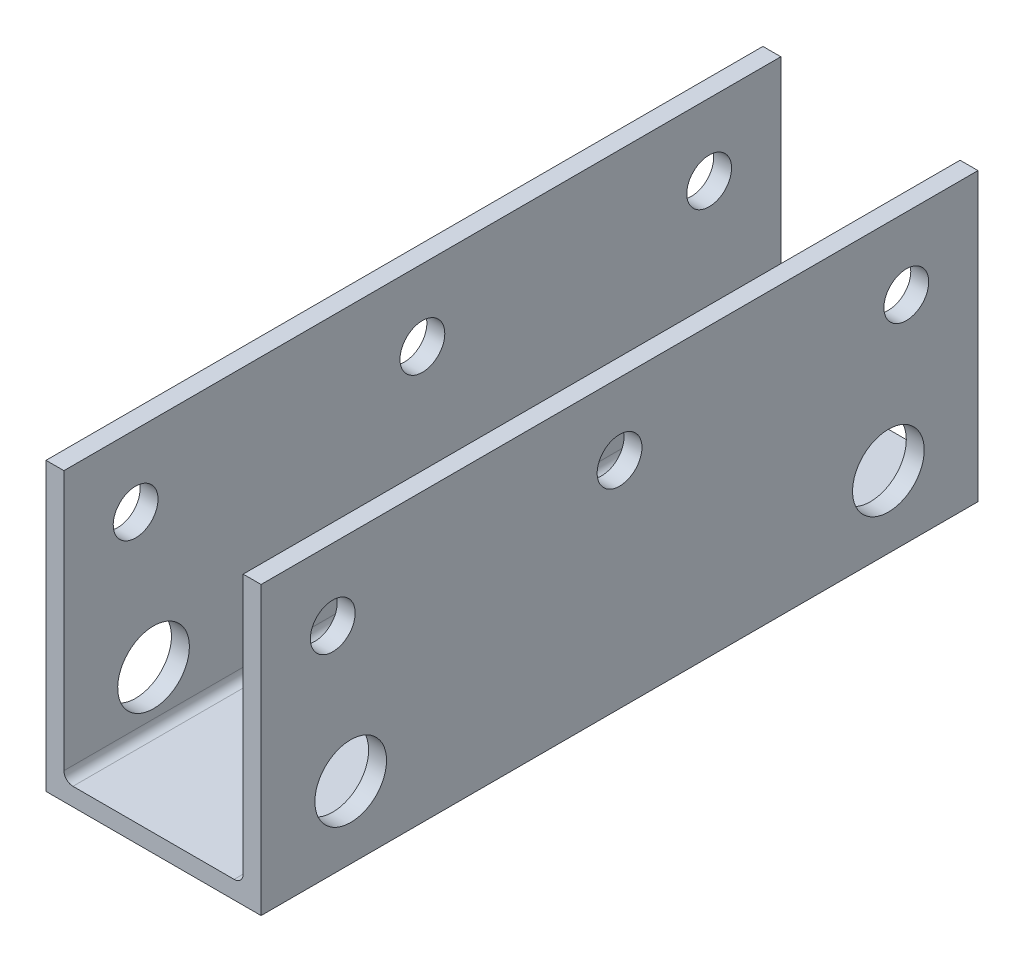
ISO-10303-21;
HEADER;
FILE_DESCRIPTION(('STEP AP214'),'2;1');
FILE_NAME('part.step','',(''),(''),'','','');
FILE_SCHEMA(('AUTOMOTIVE_DESIGN { 1 0 10303 214 1 1 1 1 }'));
ENDSEC;
DATA;
#1=APPLICATION_CONTEXT('core data for automotive mechanical design processes');
#2=APPLICATION_PROTOCOL_DEFINITION('international standard','automotive_design',2000,#1);
#3=PRODUCT_CONTEXT('',#1,'mechanical');
#4=PRODUCT('Part','Part','',(#3));
#5=PRODUCT_RELATED_PRODUCT_CATEGORY('part','',(#4));
#6=PRODUCT_DEFINITION_FORMATION('','',#4);
#7=PRODUCT_DEFINITION_CONTEXT('part definition',#1,'design');
#8=PRODUCT_DEFINITION('design','',#6,#7);
#9=PRODUCT_DEFINITION_SHAPE('','',#8);
#10=(LENGTH_UNIT() NAMED_UNIT(*) SI_UNIT(.MILLI.,.METRE.));
#11=(NAMED_UNIT(*) PLANE_ANGLE_UNIT() SI_UNIT($,.RADIAN.));
#12=(NAMED_UNIT(*) SI_UNIT($,.STERADIAN.) SOLID_ANGLE_UNIT());
#13=UNCERTAINTY_MEASURE_WITH_UNIT(LENGTH_MEASURE(1.E-05),#10,'distance_accuracy_value','');
#14=(GEOMETRIC_REPRESENTATION_CONTEXT(3) GLOBAL_UNCERTAINTY_ASSIGNED_CONTEXT((#13)) GLOBAL_UNIT_ASSIGNED_CONTEXT((#10,
#11,#12)) REPRESENTATION_CONTEXT('',''));
#15=CARTESIAN_POINT('',(0.,0.,0.));
#16=DIRECTION('',(0.,0.,1.));
#17=DIRECTION('',(1.,0.,0.));
#18=AXIS2_PLACEMENT_3D('',#15,#16,#17);
#19=CARTESIAN_POINT('',(0.,0.,127.));
#20=DIRECTION('',(1.,0.,0.));
#21=DIRECTION('',(0.,0.,-1.));
#22=AXIS2_PLACEMENT_3D('',#19,#20,#21);
#23=PLANE('',#22);
#24=CARTESIAN_POINT('',(0.,38.1,12.7));
#25=DIRECTION('',(1.,0.,0.));
#26=DIRECTION('',(0.,0.,-1.));
#27=AXIS2_PLACEMENT_3D('',#24,#25,#26);
#28=CIRCLE('',#27,3.96875);
#29=CARTESIAN_POINT('',(0.,38.1,8.73125));
#30=VERTEX_POINT('',#29);
#31=EDGE_CURVE('E265',#30,#30,#28,.T.);
#32=ORIENTED_EDGE('',*,*,#31,.T.);
#33=EDGE_LOOP('',(#32));
#34=FACE_BOUND('',#33,.T.);
#35=CARTESIAN_POINT('',(0.,38.1,63.5));
#36=DIRECTION('',(1.,0.,0.));
#37=DIRECTION('',(0.,0.,-1.));
#38=AXIS2_PLACEMENT_3D('',#35,#36,#37);
#39=CIRCLE('',#38,3.96875000000001);
#40=CARTESIAN_POINT('',(0.,38.1,59.53125));
#41=VERTEX_POINT('',#40);
#42=EDGE_CURVE('E182',#41,#41,#39,.T.);
#43=ORIENTED_EDGE('',*,*,#42,.T.);
#44=EDGE_LOOP('',(#43));
#45=FACE_BOUND('',#44,.T.);
#46=CARTESIAN_POINT('',(0.,38.1,114.3));
#47=DIRECTION('',(1.,0.,0.));
#48=DIRECTION('',(0.,0.,-1.));
#49=AXIS2_PLACEMENT_3D('',#46,#47,#48);
#50=CIRCLE('',#49,3.96874999999999);
#51=CARTESIAN_POINT('',(0.,38.1,110.33125));
#52=VERTEX_POINT('',#51);
#53=EDGE_CURVE('E177',#52,#52,#50,.T.);
#54=ORIENTED_EDGE('',*,*,#53,.T.);
#55=EDGE_LOOP('',(#54));
#56=FACE_BOUND('',#55,.T.);
#57=CARTESIAN_POINT('',(0.,12.7,111.125));
#58=DIRECTION('',(1.,0.,0.));
#59=DIRECTION('',(0.,0.,-1.));
#60=AXIS2_PLACEMENT_3D('',#57,#58,#59);
#61=CIRCLE('',#60,6.35);
#62=CARTESIAN_POINT('',(0.,12.7,104.775));
#63=VERTEX_POINT('',#62);
#64=EDGE_CURVE('E171',#63,#63,#61,.T.);
#65=ORIENTED_EDGE('',*,*,#64,.T.);
#66=EDGE_LOOP('',(#65));
#67=FACE_BOUND('',#66,.T.);
#68=CARTESIAN_POINT('',(0.,12.7,15.875));
#69=DIRECTION('',(1.,0.,0.));
#70=DIRECTION('',(0.,0.,-1.));
#71=AXIS2_PLACEMENT_3D('',#68,#69,#70);
#72=CIRCLE('',#71,6.35);
#73=CARTESIAN_POINT('',(0.,12.7,9.525));
#74=VERTEX_POINT('',#73);
#75=EDGE_CURVE('E165',#74,#74,#72,.T.);
#76=ORIENTED_EDGE('',*,*,#75,.T.);
#77=EDGE_LOOP('',(#76));
#78=FACE_BOUND('',#77,.T.);
#79=DIRECTION('',(0.,-1.,0.));
#80=VECTOR('',#79,1.);
#81=CARTESIAN_POINT('',(0.,0.,0.));
#82=LINE('',#81,#80);
#83=CARTESIAN_POINT('',(0.,50.8,0.));
#84=VERTEX_POINT('',#83);
#85=CARTESIAN_POINT('',(0.,0.,0.));
#86=VERTEX_POINT('',#85);
#87=EDGE_CURVE('E141',#84,#86,#82,.T.);
#88=ORIENTED_EDGE('',*,*,#87,.T.);
#89=DIRECTION('',(0.,0.,-1.));
#90=VECTOR('',#89,1.);
#91=CARTESIAN_POINT('',(0.,0.,127.));
#92=LINE('',#91,#90);
#93=CARTESIAN_POINT('',(0.,0.,127.));
#94=VERTEX_POINT('',#93);
#95=EDGE_CURVE('E120',#94,#86,#92,.T.);
#96=ORIENTED_EDGE('',*,*,#95,.F.);
#97=DIRECTION('',(0.,-1.,0.));
#98=VECTOR('',#97,1.);
#99=CARTESIAN_POINT('',(0.,0.,127.));
#100=LINE('',#99,#98);
#101=CARTESIAN_POINT('',(0.,50.8,127.));
#102=VERTEX_POINT('',#101);
#103=EDGE_CURVE('E128',#102,#94,#100,.T.);
#104=ORIENTED_EDGE('',*,*,#103,.F.);
#105=DIRECTION('',(0.,0.,-1.));
#106=VECTOR('',#105,1.);
#107=CARTESIAN_POINT('',(0.,50.8,127.));
#108=LINE('',#107,#106);
#109=EDGE_CURVE('E236',#102,#84,#108,.T.);
#110=ORIENTED_EDGE('',*,*,#109,.T.);
#111=EDGE_LOOP('',(#88,#96,#104,#110));
#112=FACE_BOUND('',#111,.T.);
#113=ADVANCED_FACE('F38',(#34,#45,#56,#67,#78,#112),#23,.F.);
#114=CARTESIAN_POINT('',(0.,0.,127.));
#115=DIRECTION('',(0.,1.,0.));
#116=DIRECTION('',(0.,0.,1.));
#117=AXIS2_PLACEMENT_3D('',#114,#115,#116);
#118=PLANE('',#117);
#119=DIRECTION('',(1.,0.,0.));
#120=VECTOR('',#119,1.);
#121=CARTESIAN_POINT('',(0.,0.,0.));
#122=LINE('',#121,#120);
#123=CARTESIAN_POINT('',(38.1,0.,0.));
#124=VERTEX_POINT('',#123);
#125=EDGE_CURVE('E258',#86,#124,#122,.T.);
#126=ORIENTED_EDGE('',*,*,#125,.T.);
#127=DIRECTION('',(0.,0.,-1.));
#128=VECTOR('',#127,1.);
#129=CARTESIAN_POINT('',(38.1,0.,127.));
#130=LINE('',#129,#128);
#131=CARTESIAN_POINT('',(38.1,0.,127.));
#132=VERTEX_POINT('',#131);
#133=EDGE_CURVE('E123',#132,#124,#130,.T.);
#134=ORIENTED_EDGE('',*,*,#133,.F.);
#135=DIRECTION('',(1.,0.,0.));
#136=VECTOR('',#135,1.);
#137=CARTESIAN_POINT('',(0.,0.,127.));
#138=LINE('',#137,#136);
#139=EDGE_CURVE('E116',#94,#132,#138,.T.);
#140=ORIENTED_EDGE('',*,*,#139,.F.);
#141=ORIENTED_EDGE('',*,*,#95,.T.);
#142=EDGE_LOOP('',(#126,#134,#140,#141));
#143=FACE_BOUND('',#142,.T.);
#144=ADVANCED_FACE('F118',(#143),#118,.F.);
#145=CARTESIAN_POINT('',(38.1,0.,127.));
#146=DIRECTION('',(-1.,0.,0.));
#147=DIRECTION('',(0.,0.,1.));
#148=AXIS2_PLACEMENT_3D('',#145,#146,#147);
#149=PLANE('',#148);
#150=CARTESIAN_POINT('',(38.1,38.1,12.7));
#151=DIRECTION('',(1.,0.,0.));
#152=DIRECTION('',(0.,0.,-1.));
#153=AXIS2_PLACEMENT_3D('',#150,#151,#152);
#154=CIRCLE('',#153,3.96875);
#155=CARTESIAN_POINT('',(38.1,38.1,8.73125));
#156=VERTEX_POINT('',#155);
#157=EDGE_CURVE('E311',#156,#156,#154,.T.);
#158=ORIENTED_EDGE('',*,*,#157,.F.);
#159=EDGE_LOOP('',(#158));
#160=FACE_BOUND('',#159,.T.);
#161=CARTESIAN_POINT('',(38.1,38.1,63.5));
#162=DIRECTION('',(1.,0.,0.));
#163=DIRECTION('',(0.,0.,-1.));
#164=AXIS2_PLACEMENT_3D('',#161,#162,#163);
#165=CIRCLE('',#164,3.96875000000001);
#166=CARTESIAN_POINT('',(38.1,38.1,59.53125));
#167=VERTEX_POINT('',#166);
#168=EDGE_CURVE('E315',#167,#167,#165,.T.);
#169=ORIENTED_EDGE('',*,*,#168,.F.);
#170=EDGE_LOOP('',(#169));
#171=FACE_BOUND('',#170,.T.);
#172=CARTESIAN_POINT('',(38.1,38.1,114.3));
#173=DIRECTION('',(1.,0.,0.));
#174=DIRECTION('',(0.,0.,-1.));
#175=AXIS2_PLACEMENT_3D('',#172,#173,#174);
#176=CIRCLE('',#175,3.96874999999999);
#177=CARTESIAN_POINT('',(38.1,38.1,110.33125));
#178=VERTEX_POINT('',#177);
#179=EDGE_CURVE('E319',#178,#178,#176,.T.);
#180=ORIENTED_EDGE('',*,*,#179,.F.);
#181=EDGE_LOOP('',(#180));
#182=FACE_BOUND('',#181,.T.);
#183=CARTESIAN_POINT('',(38.1,12.7,111.125));
#184=DIRECTION('',(1.,0.,0.));
#185=DIRECTION('',(0.,0.,-1.));
#186=AXIS2_PLACEMENT_3D('',#183,#184,#185);
#187=CIRCLE('',#186,6.35);
#188=CARTESIAN_POINT('',(38.1,12.7,104.775));
#189=VERTEX_POINT('',#188);
#190=EDGE_CURVE('E310',#189,#189,#187,.T.);
#191=ORIENTED_EDGE('',*,*,#190,.F.);
#192=EDGE_LOOP('',(#191));
#193=FACE_BOUND('',#192,.T.);
#194=CARTESIAN_POINT('',(38.1,12.7,15.875));
#195=DIRECTION('',(1.,0.,0.));
#196=DIRECTION('',(0.,0.,-1.));
#197=AXIS2_PLACEMENT_3D('',#194,#195,#196);
#198=CIRCLE('',#197,6.35);
#199=CARTESIAN_POINT('',(38.1,12.7,9.525));
#200=VERTEX_POINT('',#199);
#201=EDGE_CURVE('E159',#200,#200,#198,.T.);
#202=ORIENTED_EDGE('',*,*,#201,.F.);
#203=EDGE_LOOP('',(#202));
#204=FACE_BOUND('',#203,.T.);
#205=DIRECTION('',(0.,1.,0.));
#206=VECTOR('',#205,1.);
#207=CARTESIAN_POINT('',(38.1,0.,0.));
#208=LINE('',#207,#206);
#209=CARTESIAN_POINT('',(38.1,50.8,0.));
#210=VERTEX_POINT('',#209);
#211=EDGE_CURVE('E255',#124,#210,#208,.T.);
#212=ORIENTED_EDGE('',*,*,#211,.T.);
#213=DIRECTION('',(0.,0.,-1.));
#214=VECTOR('',#213,1.);
#215=CARTESIAN_POINT('',(38.1,50.8,127.));
#216=LINE('',#215,#214);
#217=CARTESIAN_POINT('',(38.1,50.8,127.));
#218=VERTEX_POINT('',#217);
#219=EDGE_CURVE('E150',#218,#210,#216,.T.);
#220=ORIENTED_EDGE('',*,*,#219,.F.);
#221=DIRECTION('',(0.,1.,0.));
#222=VECTOR('',#221,1.);
#223=CARTESIAN_POINT('',(38.1,0.,127.));
#224=LINE('',#223,#222);
#225=EDGE_CURVE('E127',#132,#218,#224,.T.);
#226=ORIENTED_EDGE('',*,*,#225,.F.);
#227=ORIENTED_EDGE('',*,*,#133,.T.);
#228=EDGE_LOOP('',(#212,#220,#226,#227));
#229=FACE_BOUND('',#228,.T.);
#230=ADVANCED_FACE('F330',(#160,#171,#182,#193,#204,#229),#149,.F.);
#231=CARTESIAN_POINT('',(34.925,50.8,127.));
#232=DIRECTION('',(0.,-1.,0.));
#233=DIRECTION('',(0.,0.,-1.));
#234=AXIS2_PLACEMENT_3D('',#231,#232,#233);
#235=PLANE('',#234);
#236=DIRECTION('',(-1.,0.,0.));
#237=VECTOR('',#236,1.);
#238=CARTESIAN_POINT('',(34.925,50.8,0.));
#239=LINE('',#238,#237);
#240=CARTESIAN_POINT('',(34.925,50.8,0.));
#241=VERTEX_POINT('',#240);
#242=EDGE_CURVE('E230',#210,#241,#239,.T.);
#243=ORIENTED_EDGE('',*,*,#242,.T.);
#244=DIRECTION('',(0.,0.,-1.));
#245=VECTOR('',#244,1.);
#246=CARTESIAN_POINT('',(34.925,50.8,127.));
#247=LINE('',#246,#245);
#248=CARTESIAN_POINT('',(34.925,50.8,127.));
#249=VERTEX_POINT('',#248);
#250=EDGE_CURVE('E241',#249,#241,#247,.T.);
#251=ORIENTED_EDGE('',*,*,#250,.F.);
#252=DIRECTION('',(-1.,0.,0.));
#253=VECTOR('',#252,1.);
#254=CARTESIAN_POINT('',(34.925,50.8,127.));
#255=LINE('',#254,#253);
#256=EDGE_CURVE('E252',#218,#249,#255,.T.);
#257=ORIENTED_EDGE('',*,*,#256,.F.);
#258=ORIENTED_EDGE('',*,*,#219,.T.);
#259=EDGE_LOOP('',(#243,#251,#257,#258));
#260=FACE_BOUND('',#259,.T.);
#261=ADVANCED_FACE('F250',(#260),#235,.F.);
#262=CARTESIAN_POINT('',(34.925,3.175,127.));
#263=DIRECTION('',(1.,0.,0.));
#264=DIRECTION('',(0.,0.,-1.));
#265=AXIS2_PLACEMENT_3D('',#262,#263,#264);
#266=PLANE('',#265);
#267=CARTESIAN_POINT('',(34.925,38.1,12.7));
#268=DIRECTION('',(1.,0.,0.));
#269=DIRECTION('',(0.,0.,-1.));
#270=AXIS2_PLACEMENT_3D('',#267,#268,#269);
#271=CIRCLE('',#270,3.96875);
#272=CARTESIAN_POINT('',(34.925,38.1,8.73125));
#273=VERTEX_POINT('',#272);
#274=EDGE_CURVE('E181',#273,#273,#271,.T.);
#275=ORIENTED_EDGE('',*,*,#274,.T.);
#276=EDGE_LOOP('',(#275));
#277=FACE_BOUND('',#276,.T.);
#278=CARTESIAN_POINT('',(34.925,38.1,63.5));
#279=DIRECTION('',(1.,0.,0.));
#280=DIRECTION('',(0.,0.,-1.));
#281=AXIS2_PLACEMENT_3D('',#278,#279,#280);
#282=CIRCLE('',#281,3.96875000000001);
#283=CARTESIAN_POINT('',(34.925,38.1,59.53125));
#284=VERTEX_POINT('',#283);
#285=EDGE_CURVE('E176',#284,#284,#282,.T.);
#286=ORIENTED_EDGE('',*,*,#285,.T.);
#287=EDGE_LOOP('',(#286));
#288=FACE_BOUND('',#287,.T.);
#289=CARTESIAN_POINT('',(34.925,38.1,114.3));
#290=DIRECTION('',(1.,0.,0.));
#291=DIRECTION('',(0.,0.,-1.));
#292=AXIS2_PLACEMENT_3D('',#289,#290,#291);
#293=CIRCLE('',#292,3.96874999999999);
#294=CARTESIAN_POINT('',(34.925,38.1,110.33125));
#295=VERTEX_POINT('',#294);
#296=EDGE_CURVE('E170',#295,#295,#293,.T.);
#297=ORIENTED_EDGE('',*,*,#296,.T.);
#298=EDGE_LOOP('',(#297));
#299=FACE_BOUND('',#298,.T.);
#300=CARTESIAN_POINT('',(34.925,12.7,111.125));
#301=DIRECTION('',(1.,0.,0.));
#302=DIRECTION('',(0.,0.,-1.));
#303=AXIS2_PLACEMENT_3D('',#300,#301,#302);
#304=CIRCLE('',#303,6.35);
#305=CARTESIAN_POINT('',(34.925,12.7,104.775));
#306=VERTEX_POINT('',#305);
#307=EDGE_CURVE('E164',#306,#306,#304,.T.);
#308=ORIENTED_EDGE('',*,*,#307,.T.);
#309=EDGE_LOOP('',(#308));
#310=FACE_BOUND('',#309,.T.);
#311=CARTESIAN_POINT('',(34.925,12.7,15.875));
#312=DIRECTION('',(1.,0.,0.));
#313=DIRECTION('',(0.,0.,-1.));
#314=AXIS2_PLACEMENT_3D('',#311,#312,#313);
#315=CIRCLE('',#314,6.35);
#316=CARTESIAN_POINT('',(34.925,12.7,9.525));
#317=VERTEX_POINT('',#316);
#318=EDGE_CURVE('E158',#317,#317,#315,.T.);
#319=ORIENTED_EDGE('',*,*,#318,.T.);
#320=EDGE_LOOP('',(#319));
#321=FACE_BOUND('',#320,.T.);
#322=DIRECTION('',(0.,-1.,0.));
#323=VECTOR('',#322,1.);
#324=CARTESIAN_POINT('',(34.925,3.175,0.));
#325=LINE('',#324,#323);
#326=CARTESIAN_POINT('',(34.925,4.7752,0.));
#327=VERTEX_POINT('',#326);
#328=EDGE_CURVE('E225',#241,#327,#325,.T.);
#329=ORIENTED_EDGE('',*,*,#328,.T.);
#330=DIRECTION('',(0.,0.,-1.));
#331=VECTOR('',#330,1.);
#332=CARTESIAN_POINT('',(34.925,4.7752,127.));
#333=LINE('',#332,#331);
#334=CARTESIAN_POINT('',(34.925,4.7752,127.));
#335=VERTEX_POINT('',#334);
#336=EDGE_CURVE('E54',#327,#335,#333,.F.);
#337=ORIENTED_EDGE('',*,*,#336,.T.);
#338=DIRECTION('',(0.,-1.,0.));
#339=VECTOR('',#338,1.);
#340=CARTESIAN_POINT('',(34.925,3.175,127.));
#341=LINE('',#340,#339);
#342=EDGE_CURVE('E270',#249,#335,#341,.T.);
#343=ORIENTED_EDGE('',*,*,#342,.F.);
#344=ORIENTED_EDGE('',*,*,#250,.T.);
#345=EDGE_LOOP('',(#329,#337,#343,#344));
#346=FACE_BOUND('',#345,.T.);
#347=ADVANCED_FACE('F337',(#277,#288,#299,#310,#321,#346),#266,.F.);
#348=CARTESIAN_POINT('',(3.175,3.175,127.));
#349=DIRECTION('',(0.,-1.,0.));
#350=DIRECTION('',(0.,0.,-1.));
#351=AXIS2_PLACEMENT_3D('',#348,#349,#350);
#352=PLANE('',#351);
#353=DIRECTION('',(-1.,0.,0.));
#354=VECTOR('',#353,1.);
#355=CARTESIAN_POINT('',(3.175,3.175,0.));
#356=LINE('',#355,#354);
#357=CARTESIAN_POINT('',(33.3248,3.175,0.));
#358=VERTEX_POINT('',#357);
#359=CARTESIAN_POINT('',(4.7752,3.175,0.));
#360=VERTEX_POINT('',#359);
#361=EDGE_CURVE('E218',#358,#360,#356,.T.);
#362=ORIENTED_EDGE('',*,*,#361,.T.);
#363=DIRECTION('',(0.,0.,-1.));
#364=VECTOR('',#363,1.);
#365=CARTESIAN_POINT('',(4.7752,3.175,127.));
#366=LINE('',#365,#364);
#367=CARTESIAN_POINT('',(4.7752,3.175,127.));
#368=VERTEX_POINT('',#367);
#369=EDGE_CURVE('E187',#360,#368,#366,.F.);
#370=ORIENTED_EDGE('',*,*,#369,.T.);
#371=DIRECTION('',(-1.,0.,0.));
#372=VECTOR('',#371,1.);
#373=CARTESIAN_POINT('',(3.175,3.175,127.));
#374=LINE('',#373,#372);
#375=CARTESIAN_POINT('',(33.3248,3.175,127.));
#376=VERTEX_POINT('',#375);
#377=EDGE_CURVE('E204',#376,#368,#374,.T.);
#378=ORIENTED_EDGE('',*,*,#377,.F.);
#379=DIRECTION('',(0.,0.,-1.));
#380=VECTOR('',#379,1.);
#381=CARTESIAN_POINT('',(33.3248,3.175,0.));
#382=LINE('',#381,#380);
#383=EDGE_CURVE('E148',#376,#358,#382,.T.);
#384=ORIENTED_EDGE('',*,*,#383,.T.);
#385=EDGE_LOOP('',(#362,#370,#378,#384));
#386=FACE_BOUND('',#385,.T.);
#387=ADVANCED_FACE('F222',(#386),#352,.F.);
#388=CARTESIAN_POINT('',(3.175,50.8,127.));
#389=DIRECTION('',(-1.,0.,0.));
#390=DIRECTION('',(0.,-1.,0.));
#391=AXIS2_PLACEMENT_3D('',#388,#389,#390);
#392=PLANE('',#391);
#393=CARTESIAN_POINT('',(3.175,38.1,12.7));
#394=DIRECTION('',(-1.,0.,0.));
#395=DIRECTION('',(0.,-1.,0.));
#396=AXIS2_PLACEMENT_3D('',#393,#394,#395);
#397=CIRCLE('',#396,3.96875);
#398=CARTESIAN_POINT('',(3.175,34.13125,12.7));
#399=VERTEX_POINT('',#398);
#400=EDGE_CURVE('E178',#399,#399,#397,.T.);
#401=ORIENTED_EDGE('',*,*,#400,.T.);
#402=EDGE_LOOP('',(#401));
#403=FACE_BOUND('',#402,.T.);
#404=CARTESIAN_POINT('',(3.175,38.1,63.5));
#405=DIRECTION('',(-1.,0.,0.));
#406=DIRECTION('',(0.,-1.,0.));
#407=AXIS2_PLACEMENT_3D('',#404,#405,#406);
#408=CIRCLE('',#407,3.96875000000001);
#409=CARTESIAN_POINT('',(3.175,34.13125,63.5));
#410=VERTEX_POINT('',#409);
#411=EDGE_CURVE('E172',#410,#410,#408,.T.);
#412=ORIENTED_EDGE('',*,*,#411,.T.);
#413=EDGE_LOOP('',(#412));
#414=FACE_BOUND('',#413,.T.);
#415=CARTESIAN_POINT('',(3.175,38.1,114.3));
#416=DIRECTION('',(-1.,0.,0.));
#417=DIRECTION('',(0.,-1.,0.));
#418=AXIS2_PLACEMENT_3D('',#415,#416,#417);
#419=CIRCLE('',#418,3.96874999999999);
#420=CARTESIAN_POINT('',(3.175,34.13125,114.3));
#421=VERTEX_POINT('',#420);
#422=EDGE_CURVE('E166',#421,#421,#419,.T.);
#423=ORIENTED_EDGE('',*,*,#422,.T.);
#424=EDGE_LOOP('',(#423));
#425=FACE_BOUND('',#424,.T.);
#426=CARTESIAN_POINT('',(3.175,12.7,111.125));
#427=DIRECTION('',(-1.,0.,0.));
#428=DIRECTION('',(0.,-1.,0.));
#429=AXIS2_PLACEMENT_3D('',#426,#427,#428);
#430=CIRCLE('',#429,6.35);
#431=CARTESIAN_POINT('',(3.175,6.35,111.125));
#432=VERTEX_POINT('',#431);
#433=EDGE_CURVE('E160',#432,#432,#430,.T.);
#434=ORIENTED_EDGE('',*,*,#433,.T.);
#435=EDGE_LOOP('',(#434));
#436=FACE_BOUND('',#435,.T.);
#437=CARTESIAN_POINT('',(3.175,12.7,15.875));
#438=DIRECTION('',(-1.,0.,0.));
#439=DIRECTION('',(0.,-1.,0.));
#440=AXIS2_PLACEMENT_3D('',#437,#438,#439);
#441=CIRCLE('',#440,6.35);
#442=CARTESIAN_POINT('',(3.175,6.35,15.875));
#443=VERTEX_POINT('',#442);
#444=EDGE_CURVE('E154',#443,#443,#441,.T.);
#445=ORIENTED_EDGE('',*,*,#444,.T.);
#446=EDGE_LOOP('',(#445));
#447=FACE_BOUND('',#446,.T.);
#448=DIRECTION('',(0.,1.,0.));
#449=VECTOR('',#448,1.);
#450=CARTESIAN_POINT('',(3.175,50.8,127.));
#451=LINE('',#450,#449);
#452=CARTESIAN_POINT('',(3.175,4.7752,127.));
#453=VERTEX_POINT('',#452);
#454=CARTESIAN_POINT('',(3.175,50.8,127.));
#455=VERTEX_POINT('',#454);
#456=EDGE_CURVE('E201',#453,#455,#451,.T.);
#457=ORIENTED_EDGE('',*,*,#456,.F.);
#458=DIRECTION('',(0.,0.,-1.));
#459=VECTOR('',#458,1.);
#460=CARTESIAN_POINT('',(3.175,4.7752,0.));
#461=LINE('',#460,#459);
#462=CARTESIAN_POINT('',(3.175,4.7752,0.));
#463=VERTEX_POINT('',#462);
#464=EDGE_CURVE('E143',#453,#463,#461,.T.);
#465=ORIENTED_EDGE('',*,*,#464,.T.);
#466=DIRECTION('',(0.,1.,0.));
#467=VECTOR('',#466,1.);
#468=CARTESIAN_POINT('',(3.175,50.8,0.));
#469=LINE('',#468,#467);
#470=CARTESIAN_POINT('',(3.175,50.8,0.));
#471=VERTEX_POINT('',#470);
#472=EDGE_CURVE('E220',#463,#471,#469,.T.);
#473=ORIENTED_EDGE('',*,*,#472,.T.);
#474=DIRECTION('',(0.,0.,-1.));
#475=VECTOR('',#474,1.);
#476=CARTESIAN_POINT('',(3.175,50.8,127.));
#477=LINE('',#476,#475);
#478=EDGE_CURVE('E212',#455,#471,#477,.T.);
#479=ORIENTED_EDGE('',*,*,#478,.F.);
#480=EDGE_LOOP('',(#457,#465,#473,#479));
#481=FACE_BOUND('',#480,.T.);
#482=ADVANCED_FACE('F209',(#403,#414,#425,#436,#447,#481),#392,.F.);
#483=CARTESIAN_POINT('',(0.,50.8,127.));
#484=DIRECTION('',(0.,-1.,0.));
#485=DIRECTION('',(0.,0.,-1.));
#486=AXIS2_PLACEMENT_3D('',#483,#484,#485);
#487=PLANE('',#486);
#488=DIRECTION('',(-1.,0.,0.));
#489=VECTOR('',#488,1.);
#490=CARTESIAN_POINT('',(0.,50.8,0.));
#491=LINE('',#490,#489);
#492=EDGE_CURVE('E138',#471,#84,#491,.T.);
#493=ORIENTED_EDGE('',*,*,#492,.T.);
#494=ORIENTED_EDGE('',*,*,#109,.F.);
#495=DIRECTION('',(-1.,0.,0.));
#496=VECTOR('',#495,1.);
#497=CARTESIAN_POINT('',(0.,50.8,127.));
#498=LINE('',#497,#496);
#499=EDGE_CURVE('E133',#455,#102,#498,.T.);
#500=ORIENTED_EDGE('',*,*,#499,.F.);
#501=ORIENTED_EDGE('',*,*,#478,.T.);
#502=EDGE_LOOP('',(#493,#494,#500,#501));
#503=FACE_BOUND('',#502,.T.);
#504=ADVANCED_FACE('F393',(#503),#487,.F.);
#505=CARTESIAN_POINT('',(0.,0.,127.));
#506=DIRECTION('',(0.,0.,-1.));
#507=DIRECTION('',(-1.,0.,0.));
#508=AXIS2_PLACEMENT_3D('',#505,#506,#507);
#509=PLANE('',#508);
#510=ORIENTED_EDGE('',*,*,#103,.T.);
#511=ORIENTED_EDGE('',*,*,#139,.T.);
#512=ORIENTED_EDGE('',*,*,#225,.T.);
#513=ORIENTED_EDGE('',*,*,#256,.T.);
#514=ORIENTED_EDGE('',*,*,#342,.T.);
#515=CARTESIAN_POINT('',(33.3248,4.7752,127.));
#516=DIRECTION('',(0.,0.,-1.));
#517=DIRECTION('',(-1.,0.,0.));
#518=AXIS2_PLACEMENT_3D('',#515,#516,#517);
#519=CIRCLE('',#518,1.6002);
#520=EDGE_CURVE('E11',#335,#376,#519,.T.);
#521=ORIENTED_EDGE('',*,*,#520,.T.);
#522=ORIENTED_EDGE('',*,*,#377,.T.);
#523=CARTESIAN_POINT('',(4.7752,4.7752,127.));
#524=DIRECTION('',(0.,0.,-1.));
#525=DIRECTION('',(-1.,0.,0.));
#526=AXIS2_PLACEMENT_3D('',#523,#524,#525);
#527=CIRCLE('',#526,1.6002);
#528=EDGE_CURVE('E195',#368,#453,#527,.T.);
#529=ORIENTED_EDGE('',*,*,#528,.T.);
#530=ORIENTED_EDGE('',*,*,#456,.T.);
#531=ORIENTED_EDGE('',*,*,#499,.T.);
#532=EDGE_LOOP('',(#510,#511,#512,#513,#514,#521,#522,#529,#530,#531));
#533=FACE_BOUND('',#532,.T.);
#534=ADVANCED_FACE('F131',(#533),#509,.F.);
#535=CARTESIAN_POINT('',(0.,0.,0.));
#536=DIRECTION('',(0.,0.,-1.));
#537=DIRECTION('',(-1.,0.,0.));
#538=AXIS2_PLACEMENT_3D('',#535,#536,#537);
#539=PLANE('',#538);
#540=ORIENTED_EDGE('',*,*,#87,.F.);
#541=ORIENTED_EDGE('',*,*,#492,.F.);
#542=ORIENTED_EDGE('',*,*,#472,.F.);
#543=CARTESIAN_POINT('',(4.7752,4.7752,0.));
#544=DIRECTION('',(0.,0.,-1.));
#545=DIRECTION('',(-1.,0.,0.));
#546=AXIS2_PLACEMENT_3D('',#543,#544,#545);
#547=CIRCLE('',#546,1.6002);
#548=EDGE_CURVE('E192',#463,#360,#547,.F.);
#549=ORIENTED_EDGE('',*,*,#548,.T.);
#550=ORIENTED_EDGE('',*,*,#361,.F.);
#551=CARTESIAN_POINT('',(33.3248,4.7752,0.));
#552=DIRECTION('',(0.,0.,-1.));
#553=DIRECTION('',(-1.,0.,0.));
#554=AXIS2_PLACEMENT_3D('',#551,#552,#553);
#555=CIRCLE('',#554,1.6002);
#556=EDGE_CURVE('E47',#358,#327,#555,.F.);
#557=ORIENTED_EDGE('',*,*,#556,.T.);
#558=ORIENTED_EDGE('',*,*,#328,.F.);
#559=ORIENTED_EDGE('',*,*,#242,.F.);
#560=ORIENTED_EDGE('',*,*,#211,.F.);
#561=ORIENTED_EDGE('',*,*,#125,.F.);
#562=EDGE_LOOP('',(#540,#541,#542,#549,#550,#557,#558,#559,#560,#561));
#563=FACE_BOUND('',#562,.T.);
#564=ADVANCED_FACE('F217',(#563),#539,.T.);
#565=CARTESIAN_POINT('',(-114.3,12.7,15.875));
#566=DIRECTION('',(1.,0.,0.));
#567=DIRECTION('',(0.,0.,-1.));
#568=AXIS2_PLACEMENT_3D('',#565,#566,#567);
#569=CYLINDRICAL_SURFACE('',#568,6.35);
#570=ORIENTED_EDGE('',*,*,#444,.F.);
#571=EDGE_LOOP('',(#570));
#572=FACE_BOUND('',#571,.T.);
#573=ORIENTED_EDGE('',*,*,#75,.F.);
#574=EDGE_LOOP('',(#573));
#575=FACE_BOUND('',#574,.T.);
#576=ADVANCED_FACE('F384',(#572,#575),#569,.F.);
#577=CARTESIAN_POINT('',(-114.3,12.7,111.125));
#578=DIRECTION('',(1.,0.,0.));
#579=DIRECTION('',(0.,0.,-1.));
#580=AXIS2_PLACEMENT_3D('',#577,#578,#579);
#581=CYLINDRICAL_SURFACE('',#580,6.35);
#582=ORIENTED_EDGE('',*,*,#433,.F.);
#583=EDGE_LOOP('',(#582));
#584=FACE_BOUND('',#583,.T.);
#585=ORIENTED_EDGE('',*,*,#64,.F.);
#586=EDGE_LOOP('',(#585));
#587=FACE_BOUND('',#586,.T.);
#588=ADVANCED_FACE('F405',(#584,#587),#581,.F.);
#589=CARTESIAN_POINT('',(-114.3,38.1,114.3));
#590=DIRECTION('',(1.,0.,0.));
#591=DIRECTION('',(0.,0.,-1.));
#592=AXIS2_PLACEMENT_3D('',#589,#590,#591);
#593=CYLINDRICAL_SURFACE('',#592,3.96874999999999);
#594=ORIENTED_EDGE('',*,*,#422,.F.);
#595=EDGE_LOOP('',(#594));
#596=FACE_BOUND('',#595,.T.);
#597=ORIENTED_EDGE('',*,*,#53,.F.);
#598=EDGE_LOOP('',(#597));
#599=FACE_BOUND('',#598,.T.);
#600=ADVANCED_FACE('F385',(#596,#599),#593,.F.);
#601=CARTESIAN_POINT('',(-114.3,38.1,63.5));
#602=DIRECTION('',(1.,0.,0.));
#603=DIRECTION('',(0.,0.,-1.));
#604=AXIS2_PLACEMENT_3D('',#601,#602,#603);
#605=CYLINDRICAL_SURFACE('',#604,3.96875000000001);
#606=ORIENTED_EDGE('',*,*,#411,.F.);
#607=EDGE_LOOP('',(#606));
#608=FACE_BOUND('',#607,.T.);
#609=ORIENTED_EDGE('',*,*,#42,.F.);
#610=EDGE_LOOP('',(#609));
#611=FACE_BOUND('',#610,.T.);
#612=ADVANCED_FACE('F373',(#608,#611),#605,.F.);
#613=CARTESIAN_POINT('',(-114.3,38.1,12.7));
#614=DIRECTION('',(1.,0.,0.));
#615=DIRECTION('',(0.,0.,-1.));
#616=AXIS2_PLACEMENT_3D('',#613,#614,#615);
#617=CYLINDRICAL_SURFACE('',#616,3.96875);
#618=ORIENTED_EDGE('',*,*,#400,.F.);
#619=EDGE_LOOP('',(#618));
#620=FACE_BOUND('',#619,.T.);
#621=ORIENTED_EDGE('',*,*,#31,.F.);
#622=EDGE_LOOP('',(#621));
#623=FACE_BOUND('',#622,.T.);
#624=ADVANCED_FACE('F367',(#620,#623),#617,.F.);
#625=ORIENTED_EDGE('',*,*,#201,.T.);
#626=EDGE_LOOP('',(#625));
#627=FACE_BOUND('',#626,.T.);
#628=ORIENTED_EDGE('',*,*,#318,.F.);
#629=EDGE_LOOP('',(#628));
#630=FACE_BOUND('',#629,.T.);
#631=ADVANCED_FACE('F377',(#627,#630),#569,.F.);
#632=ORIENTED_EDGE('',*,*,#190,.T.);
#633=EDGE_LOOP('',(#632));
#634=FACE_BOUND('',#633,.T.);
#635=ORIENTED_EDGE('',*,*,#307,.F.);
#636=EDGE_LOOP('',(#635));
#637=FACE_BOUND('',#636,.T.);
#638=ADVANCED_FACE('F327',(#634,#637),#581,.F.);
#639=ORIENTED_EDGE('',*,*,#179,.T.);
#640=EDGE_LOOP('',(#639));
#641=FACE_BOUND('',#640,.T.);
#642=ORIENTED_EDGE('',*,*,#296,.F.);
#643=EDGE_LOOP('',(#642));
#644=FACE_BOUND('',#643,.T.);
#645=ADVANCED_FACE('F370',(#641,#644),#593,.F.);
#646=ORIENTED_EDGE('',*,*,#168,.T.);
#647=EDGE_LOOP('',(#646));
#648=FACE_BOUND('',#647,.T.);
#649=ORIENTED_EDGE('',*,*,#285,.F.);
#650=EDGE_LOOP('',(#649));
#651=FACE_BOUND('',#650,.T.);
#652=ADVANCED_FACE('F364',(#648,#651),#605,.F.);
#653=ORIENTED_EDGE('',*,*,#157,.T.);
#654=EDGE_LOOP('',(#653));
#655=FACE_BOUND('',#654,.T.);
#656=ORIENTED_EDGE('',*,*,#274,.F.);
#657=EDGE_LOOP('',(#656));
#658=FACE_BOUND('',#657,.T.);
#659=ADVANCED_FACE('F358',(#655,#658),#617,.F.);
#660=CARTESIAN_POINT('',(4.7752,4.7752,127.));
#661=DIRECTION('',(0.,0.,1.));
#662=DIRECTION('',(1.,0.,0.));
#663=AXIS2_PLACEMENT_3D('',#660,#661,#662);
#664=CYLINDRICAL_SURFACE('',#663,1.6002);
#665=ORIENTED_EDGE('',*,*,#528,.F.);
#666=ORIENTED_EDGE('',*,*,#369,.F.);
#667=ORIENTED_EDGE('',*,*,#548,.F.);
#668=ORIENTED_EDGE('',*,*,#464,.F.);
#669=EDGE_LOOP('',(#665,#666,#667,#668));
#670=FACE_BOUND('',#669,.T.);
#671=ADVANCED_FACE('F215',(#670),#664,.F.);
#672=CARTESIAN_POINT('',(33.3248,4.7752,127.));
#673=DIRECTION('',(0.,0.,1.));
#674=DIRECTION('',(1.,0.,0.));
#675=AXIS2_PLACEMENT_3D('',#672,#673,#674);
#676=CYLINDRICAL_SURFACE('',#675,1.6002);
#677=ORIENTED_EDGE('',*,*,#520,.F.);
#678=ORIENTED_EDGE('',*,*,#336,.F.);
#679=ORIENTED_EDGE('',*,*,#556,.F.);
#680=ORIENTED_EDGE('',*,*,#383,.F.);
#681=EDGE_LOOP('',(#677,#678,#679,#680));
#682=FACE_BOUND('',#681,.T.);
#683=ADVANCED_FACE('F40',(#682),#676,.F.);
#684=CLOSED_SHELL('',(#113,#144,#230,#261,#347,#387,#482,#504,#534,#564,#576,#588,#600,#612,
#624,#631,#638,#645,#652,#659,#671,#683));
#685=MANIFOLD_SOLID_BREP('B2',#684);
#686=ADVANCED_BREP_SHAPE_REPRESENTATION('',(#18,#685),#14);
#687=SHAPE_DEFINITION_REPRESENTATION(#9,#686);
ENDSEC;
END-ISO-10303-21;
